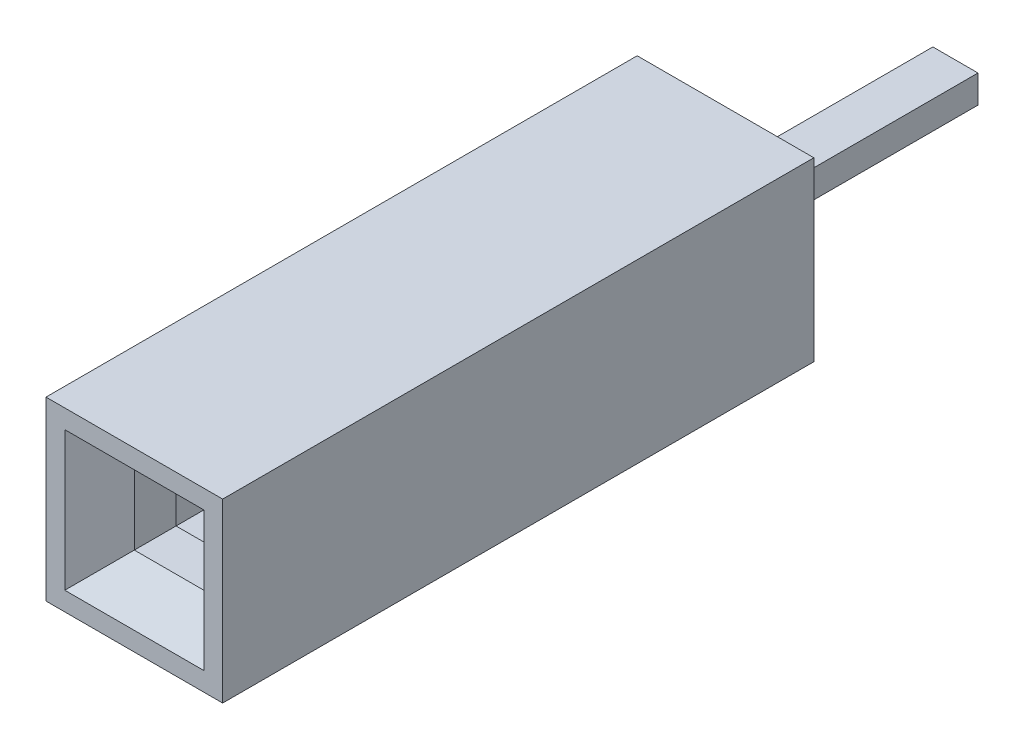
ISO-10303-21;
HEADER;
FILE_DESCRIPTION(('STEP AP214'),'2;1');
FILE_NAME('part.step','',(''),(''),'','','');
FILE_SCHEMA(('AUTOMOTIVE_DESIGN { 1 0 10303 214 1 1 1 1 }'));
ENDSEC;
DATA;
#1=APPLICATION_CONTEXT('core data for automotive mechanical design processes');
#2=APPLICATION_PROTOCOL_DEFINITION('international standard','automotive_design',2000,#1);
#3=PRODUCT_CONTEXT('',#1,'mechanical');
#4=PRODUCT('Part','Part','',(#3));
#5=PRODUCT_RELATED_PRODUCT_CATEGORY('part','',(#4));
#6=PRODUCT_DEFINITION_FORMATION('','',#4);
#7=PRODUCT_DEFINITION_CONTEXT('part definition',#1,'design');
#8=PRODUCT_DEFINITION('design','',#6,#7);
#9=PRODUCT_DEFINITION_SHAPE('','',#8);
#10=(LENGTH_UNIT() NAMED_UNIT(*) SI_UNIT(.MILLI.,.METRE.));
#11=(NAMED_UNIT(*) PLANE_ANGLE_UNIT() SI_UNIT($,.RADIAN.));
#12=(NAMED_UNIT(*) SI_UNIT($,.STERADIAN.) SOLID_ANGLE_UNIT());
#13=UNCERTAINTY_MEASURE_WITH_UNIT(LENGTH_MEASURE(1.E-05),#10,'distance_accuracy_value','');
#14=(GEOMETRIC_REPRESENTATION_CONTEXT(3) GLOBAL_UNCERTAINTY_ASSIGNED_CONTEXT((#13)) GLOBAL_UNIT_ASSIGNED_CONTEXT((#10,
#11,#12)) REPRESENTATION_CONTEXT('',''));
#15=CARTESIAN_POINT('',(0.,0.,0.));
#16=DIRECTION('',(0.,0.,1.));
#17=DIRECTION('',(1.,0.,0.));
#18=AXIS2_PLACEMENT_3D('',#15,#16,#17);
#19=CARTESIAN_POINT('',(0.,0.2,0.284306438184069));
#20=DIRECTION('',(0.,1.,0.));
#21=DIRECTION('',(-1.,0.,0.));
#22=AXIS2_PLACEMENT_3D('',#19,#20,#21);
#23=PLANE('',#22);
#24=DIRECTION('',(0.,0.,-1.));
#25=VECTOR('',#24,1.);
#26=CARTESIAN_POINT('',(0.324469626937749,0.2,-4.39155100923728));
#27=LINE('',#26,#25);
#28=CARTESIAN_POINT('',(0.324469626937751,0.2,-3.30561615123749));
#29=VERTEX_POINT('',#28);
#30=CARTESIAN_POINT('',(0.324469626937749,0.2,0.888283848762512));
#31=VERTEX_POINT('',#30);
#32=EDGE_CURVE('P0_E39',#29,#31,#27,.F.);
#33=ORIENTED_EDGE('',*,*,#32,.F.);
#34=DIRECTION('',(1.,0.,0.));
#35=VECTOR('',#34,1.);
#36=CARTESIAN_POINT('',(-0.324469626937749,0.2,-3.30561615123749));
#37=LINE('',#36,#35);
#38=CARTESIAN_POINT('',(-0.324469626937749,0.2,-3.30561615123749));
#39=VERTEX_POINT('',#38);
#40=EDGE_CURVE('P0_E299',#39,#29,#37,.T.);
#41=ORIENTED_EDGE('',*,*,#40,.F.);
#42=DIRECTION('',(0.,0.,1.));
#43=VECTOR('',#42,1.);
#44=CARTESIAN_POINT('',(-0.324469626937749,0.2,-4.39155100923728));
#45=LINE('',#44,#43);
#46=CARTESIAN_POINT('',(-0.324469626937749,0.2,0.888283848762512));
#47=VERTEX_POINT('',#46);
#48=EDGE_CURVE('P0_E223',#47,#39,#45,.F.);
#49=ORIENTED_EDGE('',*,*,#48,.F.);
#50=DIRECTION('',(-1.,0.,0.));
#51=VECTOR('',#50,1.);
#52=CARTESIAN_POINT('',(-0.683636542540015,0.2,0.888283848762512));
#53=LINE('',#52,#51);
#54=CARTESIAN_POINT('',(-1.04280345814228,0.2,0.888283848762512));
#55=VERTEX_POINT('',#54);
#56=EDGE_CURVE('P0_E155',#55,#47,#53,.F.);
#57=ORIENTED_EDGE('',*,*,#56,.F.);
#58=DIRECTION('',(0.,0.,1.));
#59=VECTOR('',#58,1.);
#60=CARTESIAN_POINT('',(-1.04280345814228,0.2,4.38077744066125));
#61=LINE('',#60,#59);
#62=CARTESIAN_POINT('',(-1.04280345814228,0.2,7.87327103255999));
#63=VERTEX_POINT('',#62);
#64=EDGE_CURVE('P0_E152',#63,#55,#61,.F.);
#65=ORIENTED_EDGE('',*,*,#64,.F.);
#66=CARTESIAN_POINT('',(-0.942803458142281,0.2,7.87327103255999));
#67=DIRECTION('',(0.,1.,0.));
#68=DIRECTION('',(0.,0.,1.));
#69=AXIS2_PLACEMENT_3D('',#66,#67,#68);
#70=CIRCLE('',#69,0.099999999999999);
#71=CARTESIAN_POINT('',(-0.850958820007972,0.2,7.91282558281629));
#72=VERTEX_POINT('',#71);
#73=EDGE_CURVE('P0_E140',#72,#63,#70,.F.);
#74=ORIENTED_EDGE('',*,*,#73,.F.);
#75=DIRECTION('',(0.395545502562963,0.,-0.918446381343088));
#76=VECTOR('',#75,1.);
#77=CARTESIAN_POINT('',(-0.72563599587616,0.2,7.6218292408588));
#78=LINE('',#77,#76);
#79=CARTESIAN_POINT('',(-0.600313171744342,0.2,7.3308328989013));
#80=VERTEX_POINT('',#79);
#81=EDGE_CURVE('P0_E135',#80,#72,#78,.F.);
#82=ORIENTED_EDGE('',*,*,#81,.F.);
#83=CARTESIAN_POINT('',(-2.98279491669871,0.2,6.42995974435727));
#84=DIRECTION('',(0.,1.,0.));
#85=DIRECTION('',(0.,0.,1.));
#86=AXIS2_PLACEMENT_3D('',#83,#84,#85);
#87=CIRCLE('',#86,2.54711438801223);
#88=CARTESIAN_POINT('',(-0.600313171744347,0.2,5.52908658981323));
#89=VERTEX_POINT('',#88);
#90=EDGE_CURVE('P0_E187',#89,#80,#87,.F.);
#91=ORIENTED_EDGE('',*,*,#90,.F.);
#92=DIRECTION('',(0.,0.,-1.));
#93=VECTOR('',#92,1.);
#94=CARTESIAN_POINT('',(-0.600313171744347,0.2,4.10337653011083));
#95=LINE('',#94,#93);
#96=CARTESIAN_POINT('',(-0.600313171744348,0.2,2.67766647040844));
#97=VERTEX_POINT('',#96);
#98=EDGE_CURVE('P0_E231',#97,#89,#95,.F.);
#99=ORIENTED_EDGE('',*,*,#98,.F.);
#100=CARTESIAN_POINT('',(0.,0.2,2.67766647040844));
#101=DIRECTION('',(0.,1.,0.));
#102=DIRECTION('',(0.,0.,1.));
#103=AXIS2_PLACEMENT_3D('',#100,#101,#102);
#104=CIRCLE('',#103,0.60031317174435);
#105=CARTESIAN_POINT('',(0.600313171744347,0.2,2.67766647040844));
#106=VERTEX_POINT('',#105);
#107=EDGE_CURVE('P0_E190',#97,#106,#104,.F.);
#108=ORIENTED_EDGE('',*,*,#107,.T.);
#109=DIRECTION('',(0.,0.,1.));
#110=VECTOR('',#109,1.);
#111=CARTESIAN_POINT('',(0.600313171744347,0.2,4.10337653011083));
#112=LINE('',#111,#110);
#113=CARTESIAN_POINT('',(0.600313171744347,0.2,5.52908658981323));
#114=VERTEX_POINT('',#113);
#115=EDGE_CURVE('P0_E193',#114,#106,#112,.F.);
#116=ORIENTED_EDGE('',*,*,#115,.F.);
#117=CARTESIAN_POINT('',(2.98279491669871,0.2,6.42995974435727));
#118=DIRECTION('',(0.,1.,0.));
#119=DIRECTION('',(0.,0.,1.));
#120=AXIS2_PLACEMENT_3D('',#117,#118,#119);
#121=CIRCLE('',#120,2.54711438801223);
#122=CARTESIAN_POINT('',(0.600313171744347,0.2,7.33083289890131));
#123=VERTEX_POINT('',#122);
#124=EDGE_CURVE('P0_E195',#123,#114,#121,.F.);
#125=ORIENTED_EDGE('',*,*,#124,.F.);
#126=DIRECTION('',(0.395545502562963,0.,0.918446381343088));
#127=VECTOR('',#126,1.);
#128=CARTESIAN_POINT('',(0.725635995876159,0.2,7.6218292408588));
#129=LINE('',#128,#127);
#130=CARTESIAN_POINT('',(0.850958820007971,0.2,7.91282558281629));
#131=VERTEX_POINT('',#130);
#132=EDGE_CURVE('P0_E235',#131,#123,#129,.F.);
#133=ORIENTED_EDGE('',*,*,#132,.F.);
#134=CARTESIAN_POINT('',(0.942803458142281,0.2,7.87327103255999));
#135=DIRECTION('',(0.,1.,0.));
#136=DIRECTION('',(0.,0.,1.));
#137=AXIS2_PLACEMENT_3D('',#134,#135,#136);
#138=CIRCLE('',#137,0.100000000000002);
#139=CARTESIAN_POINT('',(1.04280345814228,0.2,7.87327103255999));
#140=VERTEX_POINT('',#139);
#141=EDGE_CURVE('P0_E199',#140,#131,#138,.F.);
#142=ORIENTED_EDGE('',*,*,#141,.F.);
#143=DIRECTION('',(0.,0.,-1.));
#144=VECTOR('',#143,1.);
#145=CARTESIAN_POINT('',(1.04280345814228,0.2,4.38077744066125));
#146=LINE('',#145,#144);
#147=CARTESIAN_POINT('',(1.04280345814228,0.2,0.888283848762512));
#148=VERTEX_POINT('',#147);
#149=EDGE_CURVE('P0_E245',#148,#140,#146,.F.);
#150=ORIENTED_EDGE('',*,*,#149,.F.);
#151=DIRECTION('',(-1.,0.,0.));
#152=VECTOR('',#151,1.);
#153=CARTESIAN_POINT('',(0.,0.2,0.888283848762512));
#154=LINE('',#153,#152);
#155=EDGE_CURVE('P0_E239',#148,#31,#154,.T.);
#156=ORIENTED_EDGE('',*,*,#155,.T.);
#157=EDGE_LOOP('',(#33,#41,#49,#57,#65,#74,#82,#91,#99,#108,#116,#125,#133,#142,#150,#156));
#158=FACE_BOUND('',#157,.T.);
#159=ADVANCED_FACE('P0_F36',(#158),#23,.T.);
#160=CARTESIAN_POINT('',(0.324469626937749,-0.2,-4.39155100923728));
#161=DIRECTION('',(1.,0.,0.));
#162=DIRECTION('',(0.,0.,-1.));
#163=AXIS2_PLACEMENT_3D('',#160,#161,#162);
#164=PLANE('',#163);
#165=DIRECTION('',(0.,0.,1.));
#166=VECTOR('',#165,1.);
#167=CARTESIAN_POINT('',(0.324469626937749,-0.2,0.284306438184069));
#168=LINE('',#167,#166);
#169=CARTESIAN_POINT('',(0.324469626937749,-0.2,0.888283848762512));
#170=VERTEX_POINT('',#169);
#171=CARTESIAN_POINT('',(0.324469626937749,-0.2,-3.30561615123749));
#172=VERTEX_POINT('',#171);
#173=EDGE_CURVE('P0_E184',#170,#172,#168,.F.);
#174=ORIENTED_EDGE('',*,*,#173,.T.);
#175=DIRECTION('',(0.,-1.,0.));
#176=VECTOR('',#175,1.);
#177=CARTESIAN_POINT('',(0.324469626937751,0.2,-3.30561615123749));
#178=LINE('',#177,#176);
#179=EDGE_CURVE('P0_E242',#29,#172,#178,.T.);
#180=ORIENTED_EDGE('',*,*,#179,.F.);
#181=ORIENTED_EDGE('',*,*,#32,.T.);
#182=DIRECTION('',(0.,1.,0.));
#183=VECTOR('',#182,1.);
#184=CARTESIAN_POINT('',(0.324469626937749,-0.2,0.888283848762512));
#185=LINE('',#184,#183);
#186=EDGE_CURVE('P0_E251',#170,#31,#185,.T.);
#187=ORIENTED_EDGE('',*,*,#186,.F.);
#188=EDGE_LOOP('',(#174,#180,#181,#187));
#189=FACE_BOUND('',#188,.T.);
#190=ADVANCED_FACE('P0_F325',(#189),#164,.T.);
#191=CARTESIAN_POINT('',(-0.324469626937749,-0.2,-4.39155100923728));
#192=DIRECTION('',(-1.,0.,0.));
#193=DIRECTION('',(0.,0.,1.));
#194=AXIS2_PLACEMENT_3D('',#191,#192,#193);
#195=PLANE('',#194);
#196=ORIENTED_EDGE('',*,*,#48,.T.);
#197=DIRECTION('',(0.,1.,0.));
#198=VECTOR('',#197,1.);
#199=CARTESIAN_POINT('',(-0.324469626937749,-0.2,-3.30561615123749));
#200=LINE('',#199,#198);
#201=CARTESIAN_POINT('',(-0.324469626937749,-0.2,-3.30561615123749));
#202=VERTEX_POINT('',#201);
#203=EDGE_CURVE('P0_E302',#202,#39,#200,.T.);
#204=ORIENTED_EDGE('',*,*,#203,.F.);
#205=DIRECTION('',(0.,0.,1.));
#206=VECTOR('',#205,1.);
#207=CARTESIAN_POINT('',(-0.324469626937749,-0.2,0.284306438184069));
#208=LINE('',#207,#206);
#209=CARTESIAN_POINT('',(-0.324469626937749,-0.2,0.888283848762512));
#210=VERTEX_POINT('',#209);
#211=EDGE_CURVE('P0_E175',#202,#210,#208,.T.);
#212=ORIENTED_EDGE('',*,*,#211,.T.);
#213=DIRECTION('',(0.,1.,0.));
#214=VECTOR('',#213,1.);
#215=CARTESIAN_POINT('',(-0.324469626937749,-0.2,0.888283848762512));
#216=LINE('',#215,#214);
#217=EDGE_CURVE('P0_E158',#47,#210,#216,.F.);
#218=ORIENTED_EDGE('',*,*,#217,.F.);
#219=EDGE_LOOP('',(#196,#204,#212,#218));
#220=FACE_BOUND('',#219,.T.);
#221=ADVANCED_FACE('P0_F324',(#220),#195,.T.);
#222=CARTESIAN_POINT('',(-0.683636542540015,-0.2,0.888283848762512));
#223=DIRECTION('',(0.,0.,-1.));
#224=DIRECTION('',(-1.,0.,0.));
#225=AXIS2_PLACEMENT_3D('',#222,#223,#224);
#226=PLANE('',#225);
#227=DIRECTION('',(-1.,0.,0.));
#228=VECTOR('',#227,1.);
#229=CARTESIAN_POINT('',(0.,-0.2,0.888283848762512));
#230=LINE('',#229,#228);
#231=CARTESIAN_POINT('',(-1.04280345814228,-0.2,0.888283848762512));
#232=VERTEX_POINT('',#231);
#233=EDGE_CURVE('P0_E172',#210,#232,#230,.T.);
#234=ORIENTED_EDGE('',*,*,#233,.T.);
#235=DIRECTION('',(0.,1.,0.));
#236=VECTOR('',#235,1.);
#237=CARTESIAN_POINT('',(-1.04280345814228,-0.2,0.888283848762512));
#238=LINE('',#237,#236);
#239=EDGE_CURVE('P0_E149',#55,#232,#238,.F.);
#240=ORIENTED_EDGE('',*,*,#239,.F.);
#241=ORIENTED_EDGE('',*,*,#56,.T.);
#242=ORIENTED_EDGE('',*,*,#217,.T.);
#243=EDGE_LOOP('',(#234,#240,#241,#242));
#244=FACE_BOUND('',#243,.T.);
#245=ADVANCED_FACE('P0_F373',(#244),#226,.T.);
#246=CARTESIAN_POINT('',(-1.04280345814228,-0.2,4.38077744066125));
#247=DIRECTION('',(-1.,0.,0.));
#248=DIRECTION('',(0.,0.,1.));
#249=AXIS2_PLACEMENT_3D('',#246,#247,#248);
#250=PLANE('',#249);
#251=DIRECTION('',(0.,0.,1.));
#252=VECTOR('',#251,1.);
#253=CARTESIAN_POINT('',(-1.04280345814228,-0.2,0.284306438184069));
#254=LINE('',#253,#252);
#255=CARTESIAN_POINT('',(-1.04280345814228,-0.2,7.87327103255999));
#256=VERTEX_POINT('',#255);
#257=EDGE_CURVE('P0_E163',#232,#256,#254,.T.);
#258=ORIENTED_EDGE('',*,*,#257,.T.);
#259=DIRECTION('',(0.,1.,0.));
#260=VECTOR('',#259,1.);
#261=CARTESIAN_POINT('',(-1.04280345814228,-0.2,7.87327103255999));
#262=LINE('',#261,#260);
#263=EDGE_CURVE('P0_E145',#63,#256,#262,.F.);
#264=ORIENTED_EDGE('',*,*,#263,.F.);
#265=ORIENTED_EDGE('',*,*,#64,.T.);
#266=ORIENTED_EDGE('',*,*,#239,.T.);
#267=EDGE_LOOP('',(#258,#264,#265,#266));
#268=FACE_BOUND('',#267,.T.);
#269=ADVANCED_FACE('P0_F161',(#268),#250,.T.);
#270=CARTESIAN_POINT('',(-0.942803458142281,-0.2,7.87327103255999));
#271=DIRECTION('',(0.,1.,0.));
#272=DIRECTION('',(0.,0.,1.));
#273=AXIS2_PLACEMENT_3D('',#270,#271,#272);
#274=CYLINDRICAL_SURFACE('',#273,0.099999999999999);
#275=CARTESIAN_POINT('',(-0.942803458142281,-0.2,7.87327103255999));
#276=DIRECTION('',(0.,1.,0.));
#277=DIRECTION('',(0.,0.,1.));
#278=AXIS2_PLACEMENT_3D('',#275,#276,#277);
#279=CIRCLE('',#278,0.099999999999999);
#280=CARTESIAN_POINT('',(-0.850958820007972,-0.2,7.91282558281629));
#281=VERTEX_POINT('',#280);
#282=EDGE_CURVE('P0_E203',#256,#281,#279,.T.);
#283=ORIENTED_EDGE('',*,*,#282,.T.);
#284=DIRECTION('',(0.,1.,0.));
#285=VECTOR('',#284,1.);
#286=CARTESIAN_POINT('',(-0.850958820007972,-0.2,7.91282558281629));
#287=LINE('',#286,#285);
#288=EDGE_CURVE('P0_E147',#72,#281,#287,.F.);
#289=ORIENTED_EDGE('',*,*,#288,.F.);
#290=ORIENTED_EDGE('',*,*,#73,.T.);
#291=ORIENTED_EDGE('',*,*,#263,.T.);
#292=EDGE_LOOP('',(#283,#289,#290,#291));
#293=FACE_BOUND('',#292,.T.);
#294=ADVANCED_FACE('P0_F143',(#293),#274,.T.);
#295=CARTESIAN_POINT('',(-0.72563599587616,-0.2,7.6218292408588));
#296=DIRECTION('',(0.918446381343088,0.,0.395545502562963));
#297=DIRECTION('',(0.395545502562963,0.,-0.918446381343088));
#298=AXIS2_PLACEMENT_3D('',#295,#296,#297);
#299=PLANE('',#298);
#300=DIRECTION('',(0.395545502562964,0.,-0.918446381343088));
#301=VECTOR('',#300,1.);
#302=CARTESIAN_POINT('',(-0.850958820007972,-0.2,7.91282558281629));
#303=LINE('',#302,#301);
#304=CARTESIAN_POINT('',(-0.600313171744348,-0.2,7.33083289890131));
#305=VERTEX_POINT('',#304);
#306=EDGE_CURVE('P0_E205',#281,#305,#303,.T.);
#307=ORIENTED_EDGE('',*,*,#306,.T.);
#308=DIRECTION('',(0.,1.,0.));
#309=VECTOR('',#308,1.);
#310=CARTESIAN_POINT('',(-0.600313171744347,-0.2,7.33083289890131));
#311=LINE('',#310,#309);
#312=EDGE_CURVE('P0_E189',#80,#305,#311,.F.);
#313=ORIENTED_EDGE('',*,*,#312,.F.);
#314=ORIENTED_EDGE('',*,*,#81,.T.);
#315=ORIENTED_EDGE('',*,*,#288,.T.);
#316=EDGE_LOOP('',(#307,#313,#314,#315));
#317=FACE_BOUND('',#316,.T.);
#318=ADVANCED_FACE('P0_F282',(#317),#299,.T.);
#319=CARTESIAN_POINT('',(-2.98279491669871,-0.2,6.42995974435727));
#320=DIRECTION('',(0.,1.,0.));
#321=DIRECTION('',(0.,0.,1.));
#322=AXIS2_PLACEMENT_3D('',#319,#320,#321);
#323=CYLINDRICAL_SURFACE('',#322,2.54711438801223);
#324=CARTESIAN_POINT('',(-2.98279491669871,-0.2,6.42995974435727));
#325=DIRECTION('',(0.,1.,0.));
#326=DIRECTION('',(0.,0.,1.));
#327=AXIS2_PLACEMENT_3D('',#324,#325,#326);
#328=CIRCLE('',#327,2.54711438801223);
#329=CARTESIAN_POINT('',(-0.600313171744347,-0.2,5.52908658981323));
#330=VERTEX_POINT('',#329);
#331=EDGE_CURVE('P0_E206',#305,#330,#328,.T.);
#332=ORIENTED_EDGE('',*,*,#331,.T.);
#333=DIRECTION('',(0.,1.,0.));
#334=VECTOR('',#333,1.);
#335=CARTESIAN_POINT('',(-0.600313171744347,-0.2,5.52908658981323));
#336=LINE('',#335,#334);
#337=EDGE_CURVE('P0_E233',#89,#330,#336,.F.);
#338=ORIENTED_EDGE('',*,*,#337,.F.);
#339=ORIENTED_EDGE('',*,*,#90,.T.);
#340=ORIENTED_EDGE('',*,*,#312,.T.);
#341=EDGE_LOOP('',(#332,#338,#339,#340));
#342=FACE_BOUND('',#341,.T.);
#343=ADVANCED_FACE('P0_F271',(#342),#323,.T.);
#344=CARTESIAN_POINT('',(-0.600313171744347,-0.2,4.10337653011083));
#345=DIRECTION('',(1.,0.,0.));
#346=DIRECTION('',(0.,0.,-1.));
#347=AXIS2_PLACEMENT_3D('',#344,#345,#346);
#348=PLANE('',#347);
#349=DIRECTION('',(0.,0.,1.));
#350=VECTOR('',#349,1.);
#351=CARTESIAN_POINT('',(-0.600313171744347,-0.2,0.284306438184069));
#352=LINE('',#351,#350);
#353=CARTESIAN_POINT('',(-0.600313171744348,-0.2,2.67766647040844));
#354=VERTEX_POINT('',#353);
#355=EDGE_CURVE('P0_E209',#330,#354,#352,.F.);
#356=ORIENTED_EDGE('',*,*,#355,.T.);
#357=DIRECTION('',(0.,1.,0.));
#358=VECTOR('',#357,1.);
#359=CARTESIAN_POINT('',(-0.60031317174435,-0.2,2.67766647040844));
#360=LINE('',#359,#358);
#361=EDGE_CURVE('P0_E194',#354,#97,#360,.T.);
#362=ORIENTED_EDGE('',*,*,#361,.T.);
#363=ORIENTED_EDGE('',*,*,#98,.T.);
#364=ORIENTED_EDGE('',*,*,#337,.T.);
#365=EDGE_LOOP('',(#356,#362,#363,#364));
#366=FACE_BOUND('',#365,.T.);
#367=ADVANCED_FACE('P0_F360',(#366),#348,.T.);
#368=CARTESIAN_POINT('',(0.,-0.2,2.67766647040844));
#369=DIRECTION('',(0.,1.,0.));
#370=DIRECTION('',(0.,0.,1.));
#371=AXIS2_PLACEMENT_3D('',#368,#369,#370);
#372=CYLINDRICAL_SURFACE('',#371,0.60031317174435);
#373=ORIENTED_EDGE('',*,*,#361,.F.);
#374=CARTESIAN_POINT('',(0.,-0.2,2.67766647040844));
#375=DIRECTION('',(0.,1.,0.));
#376=DIRECTION('',(0.,0.,1.));
#377=AXIS2_PLACEMENT_3D('',#374,#375,#376);
#378=CIRCLE('',#377,0.60031317174435);
#379=CARTESIAN_POINT('',(0.600313171744347,-0.2,2.67766647040844));
#380=VERTEX_POINT('',#379);
#381=EDGE_CURVE('P0_E210',#354,#380,#378,.F.);
#382=ORIENTED_EDGE('',*,*,#381,.T.);
#383=DIRECTION('',(0.,1.,0.));
#384=VECTOR('',#383,1.);
#385=CARTESIAN_POINT('',(0.600313171744347,-0.2,2.67766647040844));
#386=LINE('',#385,#384);
#387=EDGE_CURVE('P0_E198',#106,#380,#386,.F.);
#388=ORIENTED_EDGE('',*,*,#387,.F.);
#389=ORIENTED_EDGE('',*,*,#107,.F.);
#390=EDGE_LOOP('',(#373,#382,#388,#389));
#391=FACE_BOUND('',#390,.T.);
#392=ADVANCED_FACE('P0_F356',(#391),#372,.F.);
#393=CARTESIAN_POINT('',(0.600313171744347,-0.2,4.10337653011083));
#394=DIRECTION('',(-1.,0.,0.));
#395=DIRECTION('',(0.,0.,1.));
#396=AXIS2_PLACEMENT_3D('',#393,#394,#395);
#397=PLANE('',#396);
#398=DIRECTION('',(0.,0.,1.));
#399=VECTOR('',#398,1.);
#400=CARTESIAN_POINT('',(0.600313171744347,-0.2,0.284306438184069));
#401=LINE('',#400,#399);
#402=CARTESIAN_POINT('',(0.600313171744347,-0.2,5.52908658981323));
#403=VERTEX_POINT('',#402);
#404=EDGE_CURVE('P0_E213',#380,#403,#401,.T.);
#405=ORIENTED_EDGE('',*,*,#404,.T.);
#406=DIRECTION('',(0.,1.,0.));
#407=VECTOR('',#406,1.);
#408=CARTESIAN_POINT('',(0.600313171744347,-0.2,5.52908658981323));
#409=LINE('',#408,#407);
#410=EDGE_CURVE('P0_E197',#114,#403,#409,.F.);
#411=ORIENTED_EDGE('',*,*,#410,.F.);
#412=ORIENTED_EDGE('',*,*,#115,.T.);
#413=ORIENTED_EDGE('',*,*,#387,.T.);
#414=EDGE_LOOP('',(#405,#411,#412,#413));
#415=FACE_BOUND('',#414,.T.);
#416=ADVANCED_FACE('P0_F352',(#415),#397,.T.);
#417=CARTESIAN_POINT('',(2.98279491669871,-0.2,6.42995974435727));
#418=DIRECTION('',(0.,1.,0.));
#419=DIRECTION('',(0.,0.,1.));
#420=AXIS2_PLACEMENT_3D('',#417,#418,#419);
#421=CYLINDRICAL_SURFACE('',#420,2.54711438801223);
#422=CARTESIAN_POINT('',(2.98279491669871,-0.2,6.42995974435727));
#423=DIRECTION('',(0.,1.,0.));
#424=DIRECTION('',(0.,0.,1.));
#425=AXIS2_PLACEMENT_3D('',#422,#423,#424);
#426=CIRCLE('',#425,2.54711438801223);
#427=CARTESIAN_POINT('',(0.600313171744346,-0.2,7.33083289890131));
#428=VERTEX_POINT('',#427);
#429=EDGE_CURVE('P0_E214',#403,#428,#426,.T.);
#430=ORIENTED_EDGE('',*,*,#429,.T.);
#431=DIRECTION('',(0.,1.,0.));
#432=VECTOR('',#431,1.);
#433=CARTESIAN_POINT('',(0.600313171744347,-0.2,7.33083289890131));
#434=LINE('',#433,#432);
#435=EDGE_CURVE('P0_E202',#123,#428,#434,.F.);
#436=ORIENTED_EDGE('',*,*,#435,.F.);
#437=ORIENTED_EDGE('',*,*,#124,.T.);
#438=ORIENTED_EDGE('',*,*,#410,.T.);
#439=EDGE_LOOP('',(#430,#436,#437,#438));
#440=FACE_BOUND('',#439,.T.);
#441=ADVANCED_FACE('P0_F348',(#440),#421,.T.);
#442=CARTESIAN_POINT('',(0.725635995876159,-0.2,7.6218292408588));
#443=DIRECTION('',(-0.918446381343088,0.,0.395545502562963));
#444=DIRECTION('',(0.395545502562963,0.,0.918446381343088));
#445=AXIS2_PLACEMENT_3D('',#442,#443,#444);
#446=PLANE('',#445);
#447=DIRECTION('',(0.395545502562964,0.,0.918446381343088));
#448=VECTOR('',#447,1.);
#449=CARTESIAN_POINT('',(0.600313171744347,-0.2,7.33083289890131));
#450=LINE('',#449,#448);
#451=CARTESIAN_POINT('',(0.850958820007971,-0.2,7.91282558281629));
#452=VERTEX_POINT('',#451);
#453=EDGE_CURVE('P0_E217',#428,#452,#450,.T.);
#454=ORIENTED_EDGE('',*,*,#453,.T.);
#455=DIRECTION('',(0.,1.,0.));
#456=VECTOR('',#455,1.);
#457=CARTESIAN_POINT('',(0.850958820007971,-0.2,7.91282558281629));
#458=LINE('',#457,#456);
#459=EDGE_CURVE('P0_E201',#131,#452,#458,.F.);
#460=ORIENTED_EDGE('',*,*,#459,.F.);
#461=ORIENTED_EDGE('',*,*,#132,.T.);
#462=ORIENTED_EDGE('',*,*,#435,.T.);
#463=EDGE_LOOP('',(#454,#460,#461,#462));
#464=FACE_BOUND('',#463,.T.);
#465=ADVANCED_FACE('P0_F344',(#464),#446,.T.);
#466=CARTESIAN_POINT('',(0.942803458142281,-0.2,7.87327103255999));
#467=DIRECTION('',(0.,1.,0.));
#468=DIRECTION('',(0.,0.,1.));
#469=AXIS2_PLACEMENT_3D('',#466,#467,#468);
#470=CYLINDRICAL_SURFACE('',#469,0.100000000000002);
#471=CARTESIAN_POINT('',(0.942803458142281,-0.2,7.87327103255999));
#472=DIRECTION('',(0.,1.,0.));
#473=DIRECTION('',(0.,0.,1.));
#474=AXIS2_PLACEMENT_3D('',#471,#472,#473);
#475=CIRCLE('',#474,0.100000000000002);
#476=CARTESIAN_POINT('',(1.04280345814228,-0.2,7.87327103255999));
#477=VERTEX_POINT('',#476);
#478=EDGE_CURVE('P0_E218',#452,#477,#475,.T.);
#479=ORIENTED_EDGE('',*,*,#478,.T.);
#480=DIRECTION('',(0.,1.,0.));
#481=VECTOR('',#480,1.);
#482=CARTESIAN_POINT('',(1.04280345814228,-0.2,7.87327103255999));
#483=LINE('',#482,#481);
#484=EDGE_CURVE('P0_E246',#140,#477,#483,.F.);
#485=ORIENTED_EDGE('',*,*,#484,.F.);
#486=ORIENTED_EDGE('',*,*,#141,.T.);
#487=ORIENTED_EDGE('',*,*,#459,.T.);
#488=EDGE_LOOP('',(#479,#485,#486,#487));
#489=FACE_BOUND('',#488,.T.);
#490=ADVANCED_FACE('P0_F337',(#489),#470,.T.);
#491=CARTESIAN_POINT('',(1.04280345814228,-0.2,4.38077744066125));
#492=DIRECTION('',(1.,0.,0.));
#493=DIRECTION('',(0.,0.,-1.));
#494=AXIS2_PLACEMENT_3D('',#491,#492,#493);
#495=PLANE('',#494);
#496=DIRECTION('',(0.,0.,1.));
#497=VECTOR('',#496,1.);
#498=CARTESIAN_POINT('',(1.04280345814228,-0.2,0.284306438184069));
#499=LINE('',#498,#497);
#500=CARTESIAN_POINT('',(1.04280345814228,-0.2,0.888283848762512));
#501=VERTEX_POINT('',#500);
#502=EDGE_CURVE('P0_E46',#477,#501,#499,.F.);
#503=ORIENTED_EDGE('',*,*,#502,.T.);
#504=DIRECTION('',(0.,1.,0.));
#505=VECTOR('',#504,1.);
#506=CARTESIAN_POINT('',(1.04280345814228,-0.2,0.888283848762512));
#507=LINE('',#506,#505);
#508=EDGE_CURVE('P0_E54',#148,#501,#507,.F.);
#509=ORIENTED_EDGE('',*,*,#508,.F.);
#510=ORIENTED_EDGE('',*,*,#149,.T.);
#511=ORIENTED_EDGE('',*,*,#484,.T.);
#512=EDGE_LOOP('',(#503,#509,#510,#511));
#513=FACE_BOUND('',#512,.T.);
#514=ADVANCED_FACE('P0_F330',(#513),#495,.T.);
#515=CARTESIAN_POINT('',(0.683636542540015,-0.2,0.888283848762512));
#516=DIRECTION('',(0.,0.,-1.));
#517=DIRECTION('',(-1.,0.,0.));
#518=AXIS2_PLACEMENT_3D('',#515,#516,#517);
#519=PLANE('',#518);
#520=DIRECTION('',(-1.,0.,0.));
#521=VECTOR('',#520,1.);
#522=CARTESIAN_POINT('',(0.,-0.2,0.888283848762512));
#523=LINE('',#522,#521);
#524=EDGE_CURVE('P0_E11',#501,#170,#523,.T.);
#525=ORIENTED_EDGE('',*,*,#524,.T.);
#526=ORIENTED_EDGE('',*,*,#186,.T.);
#527=ORIENTED_EDGE('',*,*,#155,.F.);
#528=ORIENTED_EDGE('',*,*,#508,.T.);
#529=EDGE_LOOP('',(#525,#526,#527,#528));
#530=FACE_BOUND('',#529,.T.);
#531=ADVANCED_FACE('P0_F328',(#530),#519,.T.);
#532=CARTESIAN_POINT('',(0.,-0.2,0.284306438184069));
#533=DIRECTION('',(0.,1.,0.));
#534=DIRECTION('',(-1.,0.,0.));
#535=AXIS2_PLACEMENT_3D('',#532,#533,#534);
#536=PLANE('',#535);
#537=ORIENTED_EDGE('',*,*,#211,.F.);
#538=DIRECTION('',(-1.,0.,0.));
#539=VECTOR('',#538,1.);
#540=CARTESIAN_POINT('',(0.324469626937749,-0.2,-3.30561615123749));
#541=LINE('',#540,#539);
#542=EDGE_CURVE('P0_E305',#172,#202,#541,.T.);
#543=ORIENTED_EDGE('',*,*,#542,.F.);
#544=ORIENTED_EDGE('',*,*,#173,.F.);
#545=ORIENTED_EDGE('',*,*,#524,.F.);
#546=ORIENTED_EDGE('',*,*,#502,.F.);
#547=ORIENTED_EDGE('',*,*,#478,.F.);
#548=ORIENTED_EDGE('',*,*,#453,.F.);
#549=ORIENTED_EDGE('',*,*,#429,.F.);
#550=ORIENTED_EDGE('',*,*,#404,.F.);
#551=ORIENTED_EDGE('',*,*,#381,.F.);
#552=ORIENTED_EDGE('',*,*,#355,.F.);
#553=ORIENTED_EDGE('',*,*,#331,.F.);
#554=ORIENTED_EDGE('',*,*,#306,.F.);
#555=ORIENTED_EDGE('',*,*,#282,.F.);
#556=ORIENTED_EDGE('',*,*,#257,.F.);
#557=ORIENTED_EDGE('',*,*,#233,.F.);
#558=EDGE_LOOP('',(#537,#543,#544,#545,#546,#547,#548,#549,#550,#551,#552,#553,#554,#555,#556,#557));
#559=FACE_BOUND('',#558,.T.);
#560=ADVANCED_FACE('P0_F279',(#559),#536,.F.);
#561=CARTESIAN_POINT('',(0.,0.,-3.30561615123749));
#562=DIRECTION('',(0.,0.,-1.));
#563=DIRECTION('',(-1.,0.,0.));
#564=AXIS2_PLACEMENT_3D('',#561,#562,#563);
#565=PLANE('',#564);
#566=ORIENTED_EDGE('',*,*,#542,.T.);
#567=ORIENTED_EDGE('',*,*,#203,.T.);
#568=ORIENTED_EDGE('',*,*,#40,.T.);
#569=ORIENTED_EDGE('',*,*,#179,.T.);
#570=EDGE_LOOP('',(#566,#567,#568,#569));
#571=FACE_BOUND('',#570,.T.);
#572=ADVANCED_FACE('P0_F310',(#571),#565,.T.);
#573=CLOSED_SHELL('',(#159,#190,#221,#245,#269,#294,#318,#343,#367,#392,#416,#441,#465,#490,
#514,#531,#560,#572));
#574=MANIFOLD_SOLID_BREP('P0_B2',#573);
#575=CARTESIAN_POINT('',(0.,0.,7.4));
#576=DIRECTION('',(0.,0.,1.));
#577=DIRECTION('',(1.,0.,0.));
#578=AXIS2_PLACEMENT_3D('',#575,#576,#577);
#579=PLANE('',#578);
#580=DIRECTION('',(0.,1.,0.));
#581=VECTOR('',#580,1.);
#582=CARTESIAN_POINT('',(-1.,0.,7.4));
#583=LINE('',#582,#581);
#584=CARTESIAN_POINT('',(-1.,-1.,7.4));
#585=VERTEX_POINT('',#584);
#586=CARTESIAN_POINT('',(-1.,1.,7.4));
#587=VERTEX_POINT('',#586);
#588=EDGE_CURVE('P1_E144',#585,#587,#583,.T.);
#589=ORIENTED_EDGE('',*,*,#588,.T.);
#590=DIRECTION('',(1.,0.,0.));
#591=VECTOR('',#590,1.);
#592=CARTESIAN_POINT('',(0.,1.,7.4));
#593=LINE('',#592,#591);
#594=CARTESIAN_POINT('',(1.,1.,7.4));
#595=VERTEX_POINT('',#594);
#596=EDGE_CURVE('P1_E149',#587,#595,#593,.T.);
#597=ORIENTED_EDGE('',*,*,#596,.T.);
#598=DIRECTION('',(0.,1.,0.));
#599=VECTOR('',#598,1.);
#600=CARTESIAN_POINT('',(1.,0.,7.4));
#601=LINE('',#600,#599);
#602=CARTESIAN_POINT('',(1.,-1.,7.4));
#603=VERTEX_POINT('',#602);
#604=EDGE_CURVE('P1_E154',#595,#603,#601,.F.);
#605=ORIENTED_EDGE('',*,*,#604,.T.);
#606=DIRECTION('',(1.,0.,0.));
#607=VECTOR('',#606,1.);
#608=CARTESIAN_POINT('',(0.,-1.,7.4));
#609=LINE('',#608,#607);
#610=EDGE_CURVE('P1_E161',#603,#585,#609,.F.);
#611=ORIENTED_EDGE('',*,*,#610,.T.);
#612=EDGE_LOOP('',(#589,#597,#605,#611));
#613=FACE_BOUND('',#612,.T.);
#614=DIRECTION('',(1.,0.,0.));
#615=VECTOR('',#614,1.);
#616=CARTESIAN_POINT('',(0.,-0.5,7.4));
#617=LINE('',#616,#615);
#618=CARTESIAN_POINT('',(0.5,-0.5,7.4));
#619=VERTEX_POINT('',#618);
#620=CARTESIAN_POINT('',(-0.5,-0.5,7.4));
#621=VERTEX_POINT('',#620);
#622=EDGE_CURVE('P1_E141',#619,#621,#617,.F.);
#623=ORIENTED_EDGE('',*,*,#622,.F.);
#624=DIRECTION('',(0.,1.,0.));
#625=VECTOR('',#624,1.);
#626=CARTESIAN_POINT('',(0.5,0.,7.4));
#627=LINE('',#626,#625);
#628=CARTESIAN_POINT('',(0.5,0.5,7.4));
#629=VERTEX_POINT('',#628);
#630=EDGE_CURVE('P1_E127',#629,#619,#627,.F.);
#631=ORIENTED_EDGE('',*,*,#630,.F.);
#632=DIRECTION('',(1.,0.,0.));
#633=VECTOR('',#632,1.);
#634=CARTESIAN_POINT('',(0.,0.5,7.4));
#635=LINE('',#634,#633);
#636=CARTESIAN_POINT('',(-0.5,0.5,7.4));
#637=VERTEX_POINT('',#636);
#638=EDGE_CURVE('P1_E114',#637,#629,#635,.T.);
#639=ORIENTED_EDGE('',*,*,#638,.F.);
#640=DIRECTION('',(0.,1.,0.));
#641=VECTOR('',#640,1.);
#642=CARTESIAN_POINT('',(-0.5,0.,7.4));
#643=LINE('',#642,#641);
#644=EDGE_CURVE('P1_E19',#621,#637,#643,.T.);
#645=ORIENTED_EDGE('',*,*,#644,.F.);
#646=EDGE_LOOP('',(#623,#631,#639,#645));
#647=FACE_BOUND('',#646,.T.);
#648=ADVANCED_FACE('P1_F16',(#613,#647),#579,.F.);
#649=CARTESIAN_POINT('',(-0.5,0.,8.5));
#650=DIRECTION('',(1.,0.,0.));
#651=DIRECTION('',(0.,0.,-1.));
#652=AXIS2_PLACEMENT_3D('',#649,#650,#651);
#653=PLANE('',#652);
#654=ORIENTED_EDGE('',*,*,#644,.T.);
#655=DIRECTION('',(0.,0.,-1.));
#656=VECTOR('',#655,1.);
#657=CARTESIAN_POINT('',(-0.5,0.5,8.5));
#658=LINE('',#657,#656);
#659=CARTESIAN_POINT('',(-0.5,0.5,8.));
#660=VERTEX_POINT('',#659);
#661=EDGE_CURVE('P1_E120',#660,#637,#658,.T.);
#662=ORIENTED_EDGE('',*,*,#661,.F.);
#663=DIRECTION('',(0.,1.,0.));
#664=VECTOR('',#663,1.);
#665=CARTESIAN_POINT('',(-0.499999999999999,0.,8.));
#666=LINE('',#665,#664);
#667=CARTESIAN_POINT('',(-0.5,-0.5,8.));
#668=VERTEX_POINT('',#667);
#669=EDGE_CURVE('P1_E164',#668,#660,#666,.T.);
#670=ORIENTED_EDGE('',*,*,#669,.F.);
#671=DIRECTION('',(0.,0.,1.));
#672=VECTOR('',#671,1.);
#673=CARTESIAN_POINT('',(-0.5,-0.5,8.5));
#674=LINE('',#673,#672);
#675=EDGE_CURVE('P1_E123',#621,#668,#674,.T.);
#676=ORIENTED_EDGE('',*,*,#675,.F.);
#677=EDGE_LOOP('',(#654,#662,#670,#676));
#678=FACE_BOUND('',#677,.T.);
#679=ADVANCED_FACE('P1_F119',(#678),#653,.T.);
#680=CARTESIAN_POINT('',(0.,0.5,8.5));
#681=DIRECTION('',(0.,-1.,0.));
#682=DIRECTION('',(0.,0.,-1.));
#683=AXIS2_PLACEMENT_3D('',#680,#681,#682);
#684=PLANE('',#683);
#685=ORIENTED_EDGE('',*,*,#638,.T.);
#686=DIRECTION('',(0.,0.,1.));
#687=VECTOR('',#686,1.);
#688=CARTESIAN_POINT('',(0.5,0.5,8.5));
#689=LINE('',#688,#687);
#690=CARTESIAN_POINT('',(0.5,0.5,8.));
#691=VERTEX_POINT('',#690);
#692=EDGE_CURVE('P1_E129',#691,#629,#689,.F.);
#693=ORIENTED_EDGE('',*,*,#692,.F.);
#694=DIRECTION('',(1.,0.,0.));
#695=VECTOR('',#694,1.);
#696=CARTESIAN_POINT('',(0.,0.499999999999999,8.));
#697=LINE('',#696,#695);
#698=EDGE_CURVE('P1_E133',#660,#691,#697,.T.);
#699=ORIENTED_EDGE('',*,*,#698,.F.);
#700=ORIENTED_EDGE('',*,*,#661,.T.);
#701=EDGE_LOOP('',(#685,#693,#699,#700));
#702=FACE_BOUND('',#701,.T.);
#703=ADVANCED_FACE('P1_F131',(#702),#684,.T.);
#704=CARTESIAN_POINT('',(0.5,0.,8.5));
#705=DIRECTION('',(-1.,0.,0.));
#706=DIRECTION('',(0.,0.,1.));
#707=AXIS2_PLACEMENT_3D('',#704,#705,#706);
#708=PLANE('',#707);
#709=ORIENTED_EDGE('',*,*,#630,.T.);
#710=DIRECTION('',(0.,0.,1.));
#711=VECTOR('',#710,1.);
#712=CARTESIAN_POINT('',(0.5,-0.5,8.5));
#713=LINE('',#712,#711);
#714=CARTESIAN_POINT('',(0.5,-0.5,8.));
#715=VERTEX_POINT('',#714);
#716=EDGE_CURVE('P1_E138',#715,#619,#713,.F.);
#717=ORIENTED_EDGE('',*,*,#716,.F.);
#718=DIRECTION('',(0.,1.,0.));
#719=VECTOR('',#718,1.);
#720=CARTESIAN_POINT('',(0.499999999999999,0.,8.));
#721=LINE('',#720,#719);
#722=EDGE_CURVE('P1_E170',#691,#715,#721,.F.);
#723=ORIENTED_EDGE('',*,*,#722,.F.);
#724=ORIENTED_EDGE('',*,*,#692,.T.);
#725=EDGE_LOOP('',(#709,#717,#723,#724));
#726=FACE_BOUND('',#725,.T.);
#727=ADVANCED_FACE('P1_F280',(#726),#708,.T.);
#728=CARTESIAN_POINT('',(0.,-0.5,8.5));
#729=DIRECTION('',(0.,1.,0.));
#730=DIRECTION('',(0.,0.,1.));
#731=AXIS2_PLACEMENT_3D('',#728,#729,#730);
#732=PLANE('',#731);
#733=ORIENTED_EDGE('',*,*,#622,.T.);
#734=ORIENTED_EDGE('',*,*,#675,.T.);
#735=DIRECTION('',(1.,0.,0.));
#736=VECTOR('',#735,1.);
#737=CARTESIAN_POINT('',(0.,-0.499999999999999,8.));
#738=LINE('',#737,#736);
#739=EDGE_CURVE('P1_E176',#715,#668,#738,.F.);
#740=ORIENTED_EDGE('',*,*,#739,.F.);
#741=ORIENTED_EDGE('',*,*,#716,.T.);
#742=EDGE_LOOP('',(#733,#734,#740,#741));
#743=FACE_BOUND('',#742,.T.);
#744=ADVANCED_FACE('P1_F272',(#743),#732,.T.);
#745=CARTESIAN_POINT('',(-1.,0.,0.));
#746=DIRECTION('',(-1.,0.,0.));
#747=DIRECTION('',(0.,0.,1.));
#748=AXIS2_PLACEMENT_3D('',#745,#746,#747);
#749=PLANE('',#748);
#750=DIRECTION('',(0.,0.,-1.));
#751=VECTOR('',#750,1.);
#752=CARTESIAN_POINT('',(-1.,-1.,0.));
#753=LINE('',#752,#751);
#754=CARTESIAN_POINT('',(-1.,-1.,0.));
#755=VERTEX_POINT('',#754);
#756=EDGE_CURVE('P1_E156',#585,#755,#753,.T.);
#757=ORIENTED_EDGE('',*,*,#756,.T.);
#758=DIRECTION('',(0.,1.,0.));
#759=VECTOR('',#758,1.);
#760=CARTESIAN_POINT('',(-1.,0.,0.));
#761=LINE('',#760,#759);
#762=CARTESIAN_POINT('',(-1.,1.,0.));
#763=VERTEX_POINT('',#762);
#764=EDGE_CURVE('P1_E185',#755,#763,#761,.T.);
#765=ORIENTED_EDGE('',*,*,#764,.T.);
#766=DIRECTION('',(0.,0.,1.));
#767=VECTOR('',#766,1.);
#768=CARTESIAN_POINT('',(-1.,1.,0.));
#769=LINE('',#768,#767);
#770=EDGE_CURVE('P1_E146',#763,#587,#769,.T.);
#771=ORIENTED_EDGE('',*,*,#770,.T.);
#772=ORIENTED_EDGE('',*,*,#588,.F.);
#773=EDGE_LOOP('',(#757,#765,#771,#772));
#774=FACE_BOUND('',#773,.T.);
#775=ADVANCED_FACE('P1_F270',(#774),#749,.F.);
#776=CARTESIAN_POINT('',(0.,1.,0.));
#777=DIRECTION('',(0.,1.,0.));
#778=DIRECTION('',(0.,0.,1.));
#779=AXIS2_PLACEMENT_3D('',#776,#777,#778);
#780=PLANE('',#779);
#781=ORIENTED_EDGE('',*,*,#770,.F.);
#782=DIRECTION('',(1.,0.,0.));
#783=VECTOR('',#782,1.);
#784=CARTESIAN_POINT('',(0.,1.,0.));
#785=LINE('',#784,#783);
#786=CARTESIAN_POINT('',(1.,1.,0.));
#787=VERTEX_POINT('',#786);
#788=EDGE_CURVE('P1_E187',#763,#787,#785,.T.);
#789=ORIENTED_EDGE('',*,*,#788,.T.);
#790=DIRECTION('',(0.,0.,-1.));
#791=VECTOR('',#790,1.);
#792=CARTESIAN_POINT('',(1.,1.,0.));
#793=LINE('',#792,#791);
#794=EDGE_CURVE('P1_E151',#787,#595,#793,.F.);
#795=ORIENTED_EDGE('',*,*,#794,.T.);
#796=ORIENTED_EDGE('',*,*,#596,.F.);
#797=EDGE_LOOP('',(#781,#789,#795,#796));
#798=FACE_BOUND('',#797,.T.);
#799=ADVANCED_FACE('P1_F268',(#798),#780,.F.);
#800=CARTESIAN_POINT('',(1.,0.,0.));
#801=DIRECTION('',(1.,0.,0.));
#802=DIRECTION('',(0.,0.,-1.));
#803=AXIS2_PLACEMENT_3D('',#800,#801,#802);
#804=PLANE('',#803);
#805=ORIENTED_EDGE('',*,*,#794,.F.);
#806=DIRECTION('',(0.,1.,0.));
#807=VECTOR('',#806,1.);
#808=CARTESIAN_POINT('',(1.,0.,0.));
#809=LINE('',#808,#807);
#810=CARTESIAN_POINT('',(1.,-1.,0.));
#811=VERTEX_POINT('',#810);
#812=EDGE_CURVE('P1_E189',#787,#811,#809,.F.);
#813=ORIENTED_EDGE('',*,*,#812,.T.);
#814=DIRECTION('',(0.,0.,-1.));
#815=VECTOR('',#814,1.);
#816=CARTESIAN_POINT('',(1.,-1.,0.));
#817=LINE('',#816,#815);
#818=EDGE_CURVE('P1_E158',#811,#603,#817,.F.);
#819=ORIENTED_EDGE('',*,*,#818,.T.);
#820=ORIENTED_EDGE('',*,*,#604,.F.);
#821=EDGE_LOOP('',(#805,#813,#819,#820));
#822=FACE_BOUND('',#821,.T.);
#823=ADVANCED_FACE('P1_F258',(#822),#804,.F.);
#824=CARTESIAN_POINT('',(0.,-1.,0.));
#825=DIRECTION('',(0.,-1.,0.));
#826=DIRECTION('',(0.,0.,-1.));
#827=AXIS2_PLACEMENT_3D('',#824,#825,#826);
#828=PLANE('',#827);
#829=ORIENTED_EDGE('',*,*,#818,.F.);
#830=DIRECTION('',(1.,0.,0.));
#831=VECTOR('',#830,1.);
#832=CARTESIAN_POINT('',(0.,-1.,0.));
#833=LINE('',#832,#831);
#834=EDGE_CURVE('P1_E191',#811,#755,#833,.F.);
#835=ORIENTED_EDGE('',*,*,#834,.T.);
#836=ORIENTED_EDGE('',*,*,#756,.F.);
#837=ORIENTED_EDGE('',*,*,#610,.F.);
#838=EDGE_LOOP('',(#829,#835,#836,#837));
#839=FACE_BOUND('',#838,.T.);
#840=ADVANCED_FACE('P1_F262',(#839),#828,.F.);
#841=CARTESIAN_POINT('',(-0.75,0.,8.25));
#842=DIRECTION('',(0.707106781186546,0.,0.707106781186549));
#843=DIRECTION('',(0.707106781186549,0.,-0.707106781186546));
#844=AXIS2_PLACEMENT_3D('',#841,#842,#843);
#845=PLANE('',#844);
#846=DIRECTION('',(0.,1.,0.));
#847=VECTOR('',#846,1.);
#848=CARTESIAN_POINT('',(-1.,0.,8.5));
#849=LINE('',#848,#847);
#850=CARTESIAN_POINT('',(-1.,-1.,8.5));
#851=VERTEX_POINT('',#850);
#852=CARTESIAN_POINT('',(-1.,1.,8.5));
#853=VERTEX_POINT('',#852);
#854=EDGE_CURVE('P1_E206',#851,#853,#849,.T.);
#855=ORIENTED_EDGE('',*,*,#854,.F.);
#856=DIRECTION('',(-0.577350269189625,-0.577350269189627,0.577350269189625));
#857=VECTOR('',#856,1.);
#858=CARTESIAN_POINT('',(-0.5,-0.499999999999999,8.));
#859=LINE('',#858,#857);
#860=EDGE_CURVE('P1_E179',#668,#851,#859,.T.);
#861=ORIENTED_EDGE('',*,*,#860,.F.);
#862=ORIENTED_EDGE('',*,*,#669,.T.);
#863=DIRECTION('',(0.577350269189625,-0.577350269189627,-0.577350269189625));
#864=VECTOR('',#863,1.);
#865=CARTESIAN_POINT('',(-1.,1.,8.5));
#866=LINE('',#865,#864);
#867=EDGE_CURVE('P1_E167',#853,#660,#866,.T.);
#868=ORIENTED_EDGE('',*,*,#867,.F.);
#869=EDGE_LOOP('',(#855,#861,#862,#868));
#870=FACE_BOUND('',#869,.T.);
#871=ADVANCED_FACE('P1_F308',(#870),#845,.T.);
#872=CARTESIAN_POINT('',(0.,0.75,8.25));
#873=DIRECTION('',(0.,-0.707106781186546,0.707106781186549));
#874=DIRECTION('',(0.,-0.707106781186549,-0.707106781186546));
#875=AXIS2_PLACEMENT_3D('',#872,#873,#874);
#876=PLANE('',#875);
#877=DIRECTION('',(1.,0.,0.));
#878=VECTOR('',#877,1.);
#879=CARTESIAN_POINT('',(0.,1.,8.5));
#880=LINE('',#879,#878);
#881=CARTESIAN_POINT('',(1.,1.,8.5));
#882=VERTEX_POINT('',#881);
#883=EDGE_CURVE('P1_E209',#853,#882,#880,.T.);
#884=ORIENTED_EDGE('',*,*,#883,.F.);
#885=ORIENTED_EDGE('',*,*,#867,.T.);
#886=ORIENTED_EDGE('',*,*,#698,.T.);
#887=DIRECTION('',(-0.577350269189627,-0.577350269189625,-0.577350269189625));
#888=VECTOR('',#887,1.);
#889=CARTESIAN_POINT('',(1.,1.,8.5));
#890=LINE('',#889,#888);
#891=EDGE_CURVE('P1_E173',#882,#691,#890,.T.);
#892=ORIENTED_EDGE('',*,*,#891,.F.);
#893=EDGE_LOOP('',(#884,#885,#886,#892));
#894=FACE_BOUND('',#893,.T.);
#895=ADVANCED_FACE('P1_F304',(#894),#876,.T.);
#896=CARTESIAN_POINT('',(0.75,0.,8.25));
#897=DIRECTION('',(-0.707106781186546,0.,0.707106781186549));
#898=DIRECTION('',(0.707106781186549,0.,0.707106781186546));
#899=AXIS2_PLACEMENT_3D('',#896,#897,#898);
#900=PLANE('',#899);
#901=DIRECTION('',(0.,1.,0.));
#902=VECTOR('',#901,1.);
#903=CARTESIAN_POINT('',(1.,0.,8.5));
#904=LINE('',#903,#902);
#905=CARTESIAN_POINT('',(1.,-1.,8.5));
#906=VERTEX_POINT('',#905);
#907=EDGE_CURVE('P1_E212',#882,#906,#904,.F.);
#908=ORIENTED_EDGE('',*,*,#907,.F.);
#909=ORIENTED_EDGE('',*,*,#891,.T.);
#910=ORIENTED_EDGE('',*,*,#722,.T.);
#911=DIRECTION('',(-0.577350269189625,0.577350269189627,-0.577350269189625));
#912=VECTOR('',#911,1.);
#913=CARTESIAN_POINT('',(1.,-1.,8.5));
#914=LINE('',#913,#912);
#915=EDGE_CURVE('P1_E182',#906,#715,#914,.T.);
#916=ORIENTED_EDGE('',*,*,#915,.F.);
#917=EDGE_LOOP('',(#908,#909,#910,#916));
#918=FACE_BOUND('',#917,.T.);
#919=ADVANCED_FACE('P1_F300',(#918),#900,.T.);
#920=CARTESIAN_POINT('',(0.,-0.75,8.25));
#921=DIRECTION('',(0.,0.707106781186546,0.707106781186549));
#922=DIRECTION('',(0.,-0.707106781186549,0.707106781186546));
#923=AXIS2_PLACEMENT_3D('',#920,#921,#922);
#924=PLANE('',#923);
#925=DIRECTION('',(1.,0.,0.));
#926=VECTOR('',#925,1.);
#927=CARTESIAN_POINT('',(0.,-1.,8.5));
#928=LINE('',#927,#926);
#929=EDGE_CURVE('P1_E215',#906,#851,#928,.F.);
#930=ORIENTED_EDGE('',*,*,#929,.F.);
#931=ORIENTED_EDGE('',*,*,#915,.T.);
#932=ORIENTED_EDGE('',*,*,#739,.T.);
#933=ORIENTED_EDGE('',*,*,#860,.T.);
#934=EDGE_LOOP('',(#930,#931,#932,#933));
#935=FACE_BOUND('',#934,.T.);
#936=ADVANCED_FACE('P1_F297',(#935),#924,.T.);
#937=CARTESIAN_POINT('',(1.27,0.,8.5));
#938=DIRECTION('',(1.,0.,0.));
#939=DIRECTION('',(0.,0.,-1.));
#940=AXIS2_PLACEMENT_3D('',#937,#938,#939);
#941=PLANE('',#940);
#942=DIRECTION('',(0.,1.,0.));
#943=VECTOR('',#942,1.);
#944=CARTESIAN_POINT('',(1.27,0.,8.5));
#945=LINE('',#944,#943);
#946=CARTESIAN_POINT('',(1.27,-1.27,8.5));
#947=VERTEX_POINT('',#946);
#948=CARTESIAN_POINT('',(1.27,1.27,8.5));
#949=VERTEX_POINT('',#948);
#950=EDGE_CURVE('P1_E204',#947,#949,#945,.T.);
#951=ORIENTED_EDGE('',*,*,#950,.F.);
#952=DIRECTION('',(0.,0.,-1.));
#953=VECTOR('',#952,1.);
#954=CARTESIAN_POINT('',(1.27,-1.27,8.5));
#955=LINE('',#954,#953);
#956=CARTESIAN_POINT('',(1.27,-1.27,0.));
#957=VERTEX_POINT('',#956);
#958=EDGE_CURVE('P1_E199',#957,#947,#955,.F.);
#959=ORIENTED_EDGE('',*,*,#958,.F.);
#960=DIRECTION('',(0.,1.,0.));
#961=VECTOR('',#960,1.);
#962=CARTESIAN_POINT('',(1.27,0.,0.));
#963=LINE('',#962,#961);
#964=CARTESIAN_POINT('',(1.27,1.27,0.));
#965=VERTEX_POINT('',#964);
#966=EDGE_CURVE('P1_E194',#957,#965,#963,.T.);
#967=ORIENTED_EDGE('',*,*,#966,.T.);
#968=DIRECTION('',(0.,0.,1.));
#969=VECTOR('',#968,1.);
#970=CARTESIAN_POINT('',(1.27,1.27,8.5));
#971=LINE('',#970,#969);
#972=EDGE_CURVE('P1_E222',#949,#965,#971,.F.);
#973=ORIENTED_EDGE('',*,*,#972,.F.);
#974=EDGE_LOOP('',(#951,#959,#967,#973));
#975=FACE_BOUND('',#974,.T.);
#976=ADVANCED_FACE('P1_F242',(#975),#941,.T.);
#977=CARTESIAN_POINT('',(0.,0.,0.));
#978=DIRECTION('',(0.,0.,1.));
#979=DIRECTION('',(1.,0.,0.));
#980=AXIS2_PLACEMENT_3D('',#977,#978,#979);
#981=PLANE('',#980);
#982=DIRECTION('',(0.,1.,0.));
#983=VECTOR('',#982,1.);
#984=CARTESIAN_POINT('',(-1.27,0.,0.));
#985=LINE('',#984,#983);
#986=CARTESIAN_POINT('',(-1.27,1.27,0.));
#987=VERTEX_POINT('',#986);
#988=CARTESIAN_POINT('',(-1.27,-1.27,0.));
#989=VERTEX_POINT('',#988);
#990=EDGE_CURVE('P1_E225',#987,#989,#985,.F.);
#991=ORIENTED_EDGE('',*,*,#990,.F.);
#992=DIRECTION('',(1.,0.,0.));
#993=VECTOR('',#992,1.);
#994=CARTESIAN_POINT('',(0.,1.27,0.));
#995=LINE('',#994,#993);
#996=EDGE_CURVE('P1_E218',#965,#987,#995,.F.);
#997=ORIENTED_EDGE('',*,*,#996,.F.);
#998=ORIENTED_EDGE('',*,*,#966,.F.);
#999=DIRECTION('',(1.,0.,0.));
#1000=VECTOR('',#999,1.);
#1001=CARTESIAN_POINT('',(0.,-1.27,0.));
#1002=LINE('',#1001,#1000);
#1003=EDGE_CURVE('P1_E196',#989,#957,#1002,.T.);
#1004=ORIENTED_EDGE('',*,*,#1003,.F.);
#1005=EDGE_LOOP('',(#991,#997,#998,#1004));
#1006=FACE_BOUND('',#1005,.T.);
#1007=ORIENTED_EDGE('',*,*,#812,.F.);
#1008=ORIENTED_EDGE('',*,*,#788,.F.);
#1009=ORIENTED_EDGE('',*,*,#764,.F.);
#1010=ORIENTED_EDGE('',*,*,#834,.F.);
#1011=EDGE_LOOP('',(#1007,#1008,#1009,#1010));
#1012=FACE_BOUND('',#1011,.T.);
#1013=ADVANCED_FACE('P1_F247',(#1006,#1012),#981,.F.);
#1014=CARTESIAN_POINT('',(0.,-1.27,8.5));
#1015=DIRECTION('',(0.,-1.,0.));
#1016=DIRECTION('',(0.,0.,-1.));
#1017=AXIS2_PLACEMENT_3D('',#1014,#1015,#1016);
#1018=PLANE('',#1017);
#1019=DIRECTION('',(1.,0.,0.));
#1020=VECTOR('',#1019,1.);
#1021=CARTESIAN_POINT('',(0.,-1.27,8.5));
#1022=LINE('',#1021,#1020);
#1023=CARTESIAN_POINT('',(-1.27,-1.27,8.5));
#1024=VERTEX_POINT('',#1023);
#1025=EDGE_CURVE('P1_E201',#1024,#947,#1022,.T.);
#1026=ORIENTED_EDGE('',*,*,#1025,.F.);
#1027=DIRECTION('',(0.,0.,1.));
#1028=VECTOR('',#1027,1.);
#1029=CARTESIAN_POINT('',(-1.27,-1.27,8.5));
#1030=LINE('',#1029,#1028);
#1031=EDGE_CURVE('P1_E228',#989,#1024,#1030,.T.);
#1032=ORIENTED_EDGE('',*,*,#1031,.F.);
#1033=ORIENTED_EDGE('',*,*,#1003,.T.);
#1034=ORIENTED_EDGE('',*,*,#958,.T.);
#1035=EDGE_LOOP('',(#1026,#1032,#1033,#1034));
#1036=FACE_BOUND('',#1035,.T.);
#1037=ADVANCED_FACE('P1_F239',(#1036),#1018,.T.);
#1038=CARTESIAN_POINT('',(0.,0.,8.5));
#1039=DIRECTION('',(0.,0.,1.));
#1040=DIRECTION('',(1.,0.,0.));
#1041=AXIS2_PLACEMENT_3D('',#1038,#1039,#1040);
#1042=PLANE('',#1041);
#1043=ORIENTED_EDGE('',*,*,#907,.T.);
#1044=ORIENTED_EDGE('',*,*,#929,.T.);
#1045=ORIENTED_EDGE('',*,*,#854,.T.);
#1046=ORIENTED_EDGE('',*,*,#883,.T.);
#1047=EDGE_LOOP('',(#1043,#1044,#1045,#1046));
#1048=FACE_BOUND('',#1047,.T.);
#1049=ORIENTED_EDGE('',*,*,#950,.T.);
#1050=DIRECTION('',(1.,0.,0.));
#1051=VECTOR('',#1050,1.);
#1052=CARTESIAN_POINT('',(0.,1.27,8.5));
#1053=LINE('',#1052,#1051);
#1054=CARTESIAN_POINT('',(-1.27,1.27,8.5));
#1055=VERTEX_POINT('',#1054);
#1056=EDGE_CURVE('P1_E34',#1055,#949,#1053,.T.);
#1057=ORIENTED_EDGE('',*,*,#1056,.F.);
#1058=DIRECTION('',(0.,1.,0.));
#1059=VECTOR('',#1058,1.);
#1060=CARTESIAN_POINT('',(-1.27,0.,8.5));
#1061=LINE('',#1060,#1059);
#1062=EDGE_CURVE('P1_E25',#1024,#1055,#1061,.T.);
#1063=ORIENTED_EDGE('',*,*,#1062,.F.);
#1064=ORIENTED_EDGE('',*,*,#1025,.T.);
#1065=EDGE_LOOP('',(#1049,#1057,#1063,#1064));
#1066=FACE_BOUND('',#1065,.T.);
#1067=ADVANCED_FACE('P1_F235',(#1048,#1066),#1042,.T.);
#1068=CARTESIAN_POINT('',(0.,1.27,8.5));
#1069=DIRECTION('',(0.,1.,0.));
#1070=DIRECTION('',(0.,0.,1.));
#1071=AXIS2_PLACEMENT_3D('',#1068,#1069,#1070);
#1072=PLANE('',#1071);
#1073=ORIENTED_EDGE('',*,*,#1056,.T.);
#1074=ORIENTED_EDGE('',*,*,#972,.T.);
#1075=ORIENTED_EDGE('',*,*,#996,.T.);
#1076=DIRECTION('',(0.,0.,1.));
#1077=VECTOR('',#1076,1.);
#1078=CARTESIAN_POINT('',(-1.27,1.27,8.5));
#1079=LINE('',#1078,#1077);
#1080=EDGE_CURVE('P1_E11',#1055,#987,#1079,.F.);
#1081=ORIENTED_EDGE('',*,*,#1080,.F.);
#1082=EDGE_LOOP('',(#1073,#1074,#1075,#1081));
#1083=FACE_BOUND('',#1082,.T.);
#1084=ADVANCED_FACE('P1_F245',(#1083),#1072,.T.);
#1085=CARTESIAN_POINT('',(-1.27,0.,8.5));
#1086=DIRECTION('',(-1.,0.,0.));
#1087=DIRECTION('',(0.,0.,1.));
#1088=AXIS2_PLACEMENT_3D('',#1085,#1086,#1087);
#1089=PLANE('',#1088);
#1090=ORIENTED_EDGE('',*,*,#1062,.T.);
#1091=ORIENTED_EDGE('',*,*,#1080,.T.);
#1092=ORIENTED_EDGE('',*,*,#990,.T.);
#1093=ORIENTED_EDGE('',*,*,#1031,.T.);
#1094=EDGE_LOOP('',(#1090,#1091,#1092,#1093));
#1095=FACE_BOUND('',#1094,.T.);
#1096=ADVANCED_FACE('P1_F233',(#1095),#1089,.T.);
#1097=CLOSED_SHELL('',(#648,#679,#703,#727,#744,#775,#799,#823,#840,#871,#895,#919,#936,#976,
#1013,#1037,#1067,#1084,#1096));
#1098=MANIFOLD_SOLID_BREP('P1_B1',#1097);
#1099=ADVANCED_BREP_SHAPE_REPRESENTATION('',(#18,#574,#1098),#14);
#1100=SHAPE_DEFINITION_REPRESENTATION(#9,#1099);
ENDSEC;
END-ISO-10303-21;
